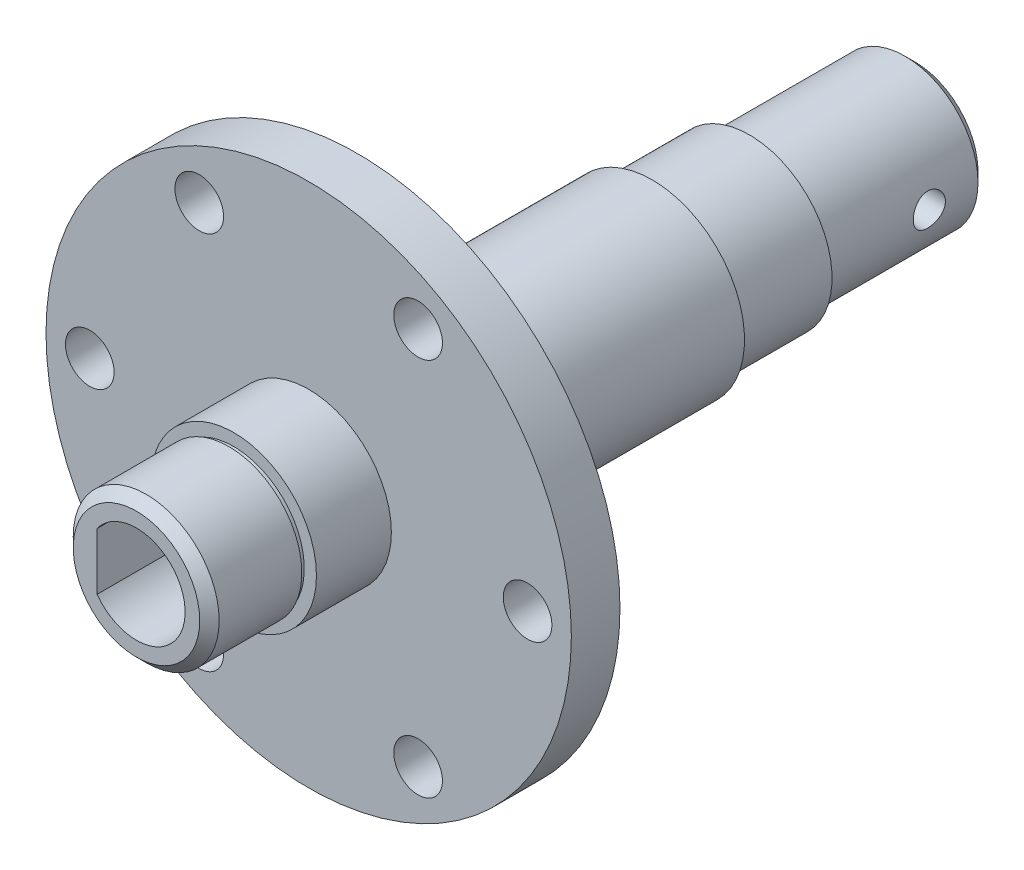
ISO-10303-21;
HEADER;
FILE_DESCRIPTION(('STEP AP214'),'2;1');
FILE_NAME('part.step','',(''),(''),'','','');
FILE_SCHEMA(('AUTOMOTIVE_DESIGN { 1 0 10303 214 1 1 1 1 }'));
ENDSEC;
DATA;
#1=APPLICATION_CONTEXT('core data for automotive mechanical design processes');
#2=APPLICATION_PROTOCOL_DEFINITION('international standard','automotive_design',2000,#1);
#3=PRODUCT_CONTEXT('',#1,'mechanical');
#4=PRODUCT('Part','Part','',(#3));
#5=PRODUCT_RELATED_PRODUCT_CATEGORY('part','',(#4));
#6=PRODUCT_DEFINITION_FORMATION('','',#4);
#7=PRODUCT_DEFINITION_CONTEXT('part definition',#1,'design');
#8=PRODUCT_DEFINITION('design','',#6,#7);
#9=PRODUCT_DEFINITION_SHAPE('','',#8);
#10=(LENGTH_UNIT() NAMED_UNIT(*) SI_UNIT(.MILLI.,.METRE.));
#11=(NAMED_UNIT(*) PLANE_ANGLE_UNIT() SI_UNIT($,.RADIAN.));
#12=(NAMED_UNIT(*) SI_UNIT($,.STERADIAN.) SOLID_ANGLE_UNIT());
#13=UNCERTAINTY_MEASURE_WITH_UNIT(LENGTH_MEASURE(1.E-05),#10,'distance_accuracy_value','');
#14=(GEOMETRIC_REPRESENTATION_CONTEXT(3) GLOBAL_UNCERTAINTY_ASSIGNED_CONTEXT((#13)) GLOBAL_UNIT_ASSIGNED_CONTEXT((#10,
#11,#12)) REPRESENTATION_CONTEXT('',''));
#15=CARTESIAN_POINT('',(0.,0.,0.));
#16=DIRECTION('',(0.,0.,1.));
#17=DIRECTION('',(1.,0.,0.));
#18=AXIS2_PLACEMENT_3D('',#15,#16,#17);
#19=CARTESIAN_POINT('',(0.,0.,64.));
#20=DIRECTION('',(0.,0.,-1.));
#21=DIRECTION('',(-1.,0.,0.));
#22=AXIS2_PLACEMENT_3D('',#19,#20,#21);
#23=CYLINDRICAL_SURFACE('',#22,7.5);
#24=CARTESIAN_POINT('',(0.,0.,63.));
#25=DIRECTION('',(0.,0.,1.));
#26=DIRECTION('',(1.,0.,0.));
#27=AXIS2_PLACEMENT_3D('',#24,#25,#26);
#28=CIRCLE('',#27,7.5);
#29=CARTESIAN_POINT('',(7.5,0.,63.));
#30=VERTEX_POINT('',#29);
#31=EDGE_CURVE('E227',#30,#30,#28,.F.);
#32=ORIENTED_EDGE('',*,*,#31,.T.);
#33=EDGE_LOOP('',(#32));
#34=FACE_BOUND('',#33,.T.);
#35=CARTESIAN_POINT('',(0.,0.,54.5));
#36=DIRECTION('',(0.,0.,-1.));
#37=DIRECTION('',(-1.,0.,0.));
#38=AXIS2_PLACEMENT_3D('',#35,#36,#37);
#39=CIRCLE('',#38,7.5);
#40=CARTESIAN_POINT('',(-7.5,0.,54.5));
#41=VERTEX_POINT('',#40);
#42=EDGE_CURVE('E327',#41,#41,#39,.T.);
#43=ORIENTED_EDGE('',*,*,#42,.F.);
#44=EDGE_LOOP('',(#43));
#45=FACE_BOUND('',#44,.T.);
#46=ADVANCED_FACE('F42',(#34,#45),#23,.T.);
#47=CARTESIAN_POINT('',(0.,0.,54.));
#48=DIRECTION('',(0.,0.,1.));
#49=DIRECTION('',(1.,0.,0.));
#50=AXIS2_PLACEMENT_3D('',#47,#48,#49);
#51=PLANE('',#50);
#52=CARTESIAN_POINT('',(0.,0.,54.));
#53=DIRECTION('',(0.,0.,1.));
#54=DIRECTION('',(1.,0.,0.));
#55=AXIS2_PLACEMENT_3D('',#52,#53,#54);
#56=CIRCLE('',#55,8.5);
#57=CARTESIAN_POINT('',(8.5,0.,54.));
#58=VERTEX_POINT('',#57);
#59=EDGE_CURVE('E313',#58,#58,#56,.T.);
#60=ORIENTED_EDGE('',*,*,#59,.T.);
#61=EDGE_LOOP('',(#60));
#62=FACE_BOUND('',#61,.T.);
#63=CARTESIAN_POINT('',(0.,0.,54.));
#64=DIRECTION('',(0.,0.,-1.));
#65=DIRECTION('',(-1.,0.,0.));
#66=AXIS2_PLACEMENT_3D('',#63,#64,#65);
#67=CIRCLE('',#66,7.25);
#68=CARTESIAN_POINT('',(-7.25,0.,54.));
#69=VERTEX_POINT('',#68);
#70=EDGE_CURVE('E298',#69,#69,#67,.T.);
#71=ORIENTED_EDGE('',*,*,#70,.T.);
#72=EDGE_LOOP('',(#71));
#73=FACE_BOUND('',#72,.T.);
#74=ADVANCED_FACE('F210',(#62,#73),#51,.T.);
#75=CARTESIAN_POINT('',(0.,0.,0.999999999999997));
#76=DIRECTION('',(0.,0.,-1.));
#77=DIRECTION('',(-1.,0.,0.));
#78=AXIS2_PLACEMENT_3D('',#75,#76,#77);
#79=PLANE('',#78);
#80=CARTESIAN_POINT('',(0.,0.,0.999999999999997));
#81=DIRECTION('',(0.,0.,-1.));
#82=DIRECTION('',(-1.,0.,0.));
#83=AXIS2_PLACEMENT_3D('',#80,#81,#82);
#84=CIRCLE('',#83,8.5);
#85=CARTESIAN_POINT('',(-8.5,0.,0.999999999999997));
#86=VERTEX_POINT('',#85);
#87=EDGE_CURVE('E292',#86,#86,#84,.T.);
#88=ORIENTED_EDGE('',*,*,#87,.T.);
#89=EDGE_LOOP('',(#88));
#90=FACE_BOUND('',#89,.T.);
#91=CARTESIAN_POINT('',(0.,0.,0.999999999999995));
#92=DIRECTION('',(0.,0.,1.));
#93=DIRECTION('',(1.,0.,0.));
#94=AXIS2_PLACEMENT_3D('',#91,#92,#93);
#95=CIRCLE('',#94,7.25);
#96=CARTESIAN_POINT('',(7.25,0.,0.999999999999995));
#97=VERTEX_POINT('',#96);
#98=EDGE_CURVE('E295',#97,#97,#95,.T.);
#99=ORIENTED_EDGE('',*,*,#98,.T.);
#100=EDGE_LOOP('',(#99));
#101=FACE_BOUND('',#100,.T.);
#102=ADVANCED_FACE('F213',(#90,#101),#79,.T.);
#103=CARTESIAN_POINT('',(0.,0.,11.3));
#104=DIRECTION('',(0.,0.,1.));
#105=DIRECTION('',(1.,0.,0.));
#106=AXIS2_PLACEMENT_3D('',#103,#104,#105);
#107=CYLINDRICAL_SURFACE('',#106,9.5);
#108=CARTESIAN_POINT('',(0.,0.,41.3));
#109=DIRECTION('',(0.,0.,-1.));
#110=DIRECTION('',(-1.,0.,0.));
#111=AXIS2_PLACEMENT_3D('',#108,#109,#110);
#112=CIRCLE('',#111,9.5);
#113=CARTESIAN_POINT('',(-9.5,0.,41.3));
#114=VERTEX_POINT('',#113);
#115=EDGE_CURVE('E149',#114,#114,#112,.T.);
#116=ORIENTED_EDGE('',*,*,#115,.T.);
#117=EDGE_LOOP('',(#116));
#118=FACE_BOUND('',#117,.T.);
#119=CARTESIAN_POINT('',(0.,0.,11.));
#120=DIRECTION('',(0.,0.,-1.));
#121=DIRECTION('',(-1.,0.,0.));
#122=AXIS2_PLACEMENT_3D('',#119,#120,#121);
#123=CIRCLE('',#122,9.5);
#124=CARTESIAN_POINT('',(-9.5,0.,11.));
#125=VERTEX_POINT('',#124);
#126=EDGE_CURVE('E172',#125,#125,#123,.T.);
#127=ORIENTED_EDGE('',*,*,#126,.F.);
#128=EDGE_LOOP('',(#127));
#129=FACE_BOUND('',#128,.T.);
#130=ADVANCED_FACE('F251',(#118,#129),#107,.T.);
#131=CARTESIAN_POINT('',(0.,0.,46.3));
#132=DIRECTION('',(0.,0.,1.));
#133=DIRECTION('',(1.,0.,0.));
#134=AXIS2_PLACEMENT_3D('',#131,#132,#133);
#135=PLANE('',#134);
#136=CARTESIAN_POINT('',(-11.2500000000001,-19.4855715851498,46.3));
#137=DIRECTION('',(0.,0.,1.));
#138=DIRECTION('',(1.,0.,0.));
#139=AXIS2_PLACEMENT_3D('',#136,#137,#138);
#140=CIRCLE('',#139,2.5);
#141=CARTESIAN_POINT('',(-8.75000000000009,-19.4855715851498,46.3));
#142=VERTEX_POINT('',#141);
#143=EDGE_CURVE('E125',#142,#142,#140,.T.);
#144=ORIENTED_EDGE('',*,*,#143,.F.);
#145=EDGE_LOOP('',(#144));
#146=FACE_BOUND('',#145,.T.);
#147=CARTESIAN_POINT('',(11.25,-19.4855715851499,46.3));
#148=DIRECTION('',(0.,0.,1.));
#149=DIRECTION('',(1.,0.,0.));
#150=AXIS2_PLACEMENT_3D('',#147,#148,#149);
#151=CIRCLE('',#150,2.5);
#152=CARTESIAN_POINT('',(13.75,-19.4855715851499,46.3));
#153=VERTEX_POINT('',#152);
#154=EDGE_CURVE('E133',#153,#153,#151,.T.);
#155=ORIENTED_EDGE('',*,*,#154,.F.);
#156=EDGE_LOOP('',(#155));
#157=FACE_BOUND('',#156,.T.);
#158=CARTESIAN_POINT('',(22.5,0.,46.3));
#159=DIRECTION('',(0.,0.,1.));
#160=DIRECTION('',(1.,0.,0.));
#161=AXIS2_PLACEMENT_3D('',#158,#159,#160);
#162=CIRCLE('',#161,2.5);
#163=CARTESIAN_POINT('',(25.,0.,46.3));
#164=VERTEX_POINT('',#163);
#165=EDGE_CURVE('E141',#164,#164,#162,.T.);
#166=ORIENTED_EDGE('',*,*,#165,.F.);
#167=EDGE_LOOP('',(#166));
#168=FACE_BOUND('',#167,.T.);
#169=CARTESIAN_POINT('',(-22.5,1.57116660247941E-13,46.3));
#170=DIRECTION('',(0.,0.,1.));
#171=DIRECTION('',(1.,0.,0.));
#172=AXIS2_PLACEMENT_3D('',#169,#170,#171);
#173=CIRCLE('',#172,2.5);
#174=CARTESIAN_POINT('',(-20.,1.57116660247941E-13,46.3));
#175=VERTEX_POINT('',#174);
#176=EDGE_CURVE('E117',#175,#175,#173,.T.);
#177=ORIENTED_EDGE('',*,*,#176,.F.);
#178=EDGE_LOOP('',(#177));
#179=FACE_BOUND('',#178,.T.);
#180=CARTESIAN_POINT('',(-11.2499999999998,19.48557158515,46.3));
#181=DIRECTION('',(0.,0.,1.));
#182=DIRECTION('',(1.,0.,0.));
#183=AXIS2_PLACEMENT_3D('',#180,#181,#182);
#184=CIRCLE('',#183,2.5);
#185=CARTESIAN_POINT('',(-8.74999999999982,19.48557158515,46.3));
#186=VERTEX_POINT('',#185);
#187=EDGE_CURVE('E109',#186,#186,#184,.T.);
#188=ORIENTED_EDGE('',*,*,#187,.F.);
#189=EDGE_LOOP('',(#188));
#190=FACE_BOUND('',#189,.T.);
#191=CARTESIAN_POINT('',(11.2500000000002,19.4855715851497,46.3));
#192=DIRECTION('',(0.,0.,1.));
#193=DIRECTION('',(1.,0.,0.));
#194=AXIS2_PLACEMENT_3D('',#191,#192,#193);
#195=CIRCLE('',#194,2.5);
#196=CARTESIAN_POINT('',(13.7500000000002,19.4855715851497,46.3));
#197=VERTEX_POINT('',#196);
#198=EDGE_CURVE('E78',#197,#197,#195,.T.);
#199=ORIENTED_EDGE('',*,*,#198,.F.);
#200=EDGE_LOOP('',(#199));
#201=FACE_BOUND('',#200,.T.);
#202=CARTESIAN_POINT('',(0.,0.,46.3));
#203=DIRECTION('',(0.,0.,1.));
#204=DIRECTION('',(1.,0.,0.));
#205=AXIS2_PLACEMENT_3D('',#202,#203,#204);
#206=CIRCLE('',#205,27.);
#207=CARTESIAN_POINT('',(27.,0.,46.3));
#208=VERTEX_POINT('',#207);
#209=EDGE_CURVE('E153',#208,#208,#206,.T.);
#210=ORIENTED_EDGE('',*,*,#209,.T.);
#211=EDGE_LOOP('',(#210));
#212=FACE_BOUND('',#211,.T.);
#213=CARTESIAN_POINT('',(0.,0.,46.3));
#214=DIRECTION('',(0.,0.,1.));
#215=DIRECTION('',(1.,0.,0.));
#216=AXIS2_PLACEMENT_3D('',#213,#214,#215);
#217=CIRCLE('',#216,8.5);
#218=CARTESIAN_POINT('',(8.5,0.,46.3));
#219=VERTEX_POINT('',#218);
#220=EDGE_CURVE('E314',#219,#219,#217,.T.);
#221=ORIENTED_EDGE('',*,*,#220,.F.);
#222=EDGE_LOOP('',(#221));
#223=FACE_BOUND('',#222,.T.);
#224=ADVANCED_FACE('F247',(#146,#157,#168,#179,#190,#201,#212,#223),#135,.T.);
#225=CARTESIAN_POINT('',(0.,0.,41.3));
#226=DIRECTION('',(0.,0.,-1.));
#227=DIRECTION('',(-1.,0.,0.));
#228=AXIS2_PLACEMENT_3D('',#225,#226,#227);
#229=PLANE('',#228);
#230=CARTESIAN_POINT('',(11.2500000000002,19.4855715851497,41.3));
#231=DIRECTION('',(0.,0.,-1.));
#232=DIRECTION('',(-1.,0.,0.));
#233=AXIS2_PLACEMENT_3D('',#230,#231,#232);
#234=CIRCLE('',#233,2.5);
#235=CARTESIAN_POINT('',(8.75000000000023,19.4855715851497,41.3));
#236=VERTEX_POINT('',#235);
#237=EDGE_CURVE('E105',#236,#236,#234,.T.);
#238=ORIENTED_EDGE('',*,*,#237,.F.);
#239=EDGE_LOOP('',(#238));
#240=FACE_BOUND('',#239,.T.);
#241=CARTESIAN_POINT('',(-11.2499999999998,19.48557158515,41.3));
#242=DIRECTION('',(0.,0.,-1.));
#243=DIRECTION('',(-1.,0.,0.));
#244=AXIS2_PLACEMENT_3D('',#241,#242,#243);
#245=CIRCLE('',#244,2.5);
#246=CARTESIAN_POINT('',(-13.7499999999998,19.48557158515,41.3));
#247=VERTEX_POINT('',#246);
#248=EDGE_CURVE('E113',#247,#247,#245,.T.);
#249=ORIENTED_EDGE('',*,*,#248,.F.);
#250=EDGE_LOOP('',(#249));
#251=FACE_BOUND('',#250,.T.);
#252=CARTESIAN_POINT('',(-22.5,1.57116660247941E-13,41.3));
#253=DIRECTION('',(0.,0.,-1.));
#254=DIRECTION('',(-1.,0.,0.));
#255=AXIS2_PLACEMENT_3D('',#252,#253,#254);
#256=CIRCLE('',#255,2.5);
#257=CARTESIAN_POINT('',(-25.,1.57116660247941E-13,41.3));
#258=VERTEX_POINT('',#257);
#259=EDGE_CURVE('E121',#258,#258,#256,.T.);
#260=ORIENTED_EDGE('',*,*,#259,.F.);
#261=EDGE_LOOP('',(#260));
#262=FACE_BOUND('',#261,.T.);
#263=CARTESIAN_POINT('',(-11.2500000000001,-19.4855715851498,41.3));
#264=DIRECTION('',(0.,0.,-1.));
#265=DIRECTION('',(-1.,0.,0.));
#266=AXIS2_PLACEMENT_3D('',#263,#264,#265);
#267=CIRCLE('',#266,2.5);
#268=CARTESIAN_POINT('',(-13.7500000000001,-19.4855715851498,41.3));
#269=VERTEX_POINT('',#268);
#270=EDGE_CURVE('E129',#269,#269,#267,.T.);
#271=ORIENTED_EDGE('',*,*,#270,.F.);
#272=EDGE_LOOP('',(#271));
#273=FACE_BOUND('',#272,.T.);
#274=CARTESIAN_POINT('',(11.25,-19.4855715851499,41.3));
#275=DIRECTION('',(0.,0.,-1.));
#276=DIRECTION('',(-1.,0.,0.));
#277=AXIS2_PLACEMENT_3D('',#274,#275,#276);
#278=CIRCLE('',#277,2.5);
#279=CARTESIAN_POINT('',(8.74999999999996,-19.4855715851499,41.3));
#280=VERTEX_POINT('',#279);
#281=EDGE_CURVE('E137',#280,#280,#278,.T.);
#282=ORIENTED_EDGE('',*,*,#281,.F.);
#283=EDGE_LOOP('',(#282));
#284=FACE_BOUND('',#283,.T.);
#285=CARTESIAN_POINT('',(22.5,0.,41.3));
#286=DIRECTION('',(0.,0.,-1.));
#287=DIRECTION('',(-1.,0.,0.));
#288=AXIS2_PLACEMENT_3D('',#285,#286,#287);
#289=CIRCLE('',#288,2.5);
#290=CARTESIAN_POINT('',(20.,0.,41.3));
#291=VERTEX_POINT('',#290);
#292=EDGE_CURVE('E145',#291,#291,#289,.T.);
#293=ORIENTED_EDGE('',*,*,#292,.F.);
#294=EDGE_LOOP('',(#293));
#295=FACE_BOUND('',#294,.T.);
#296=CARTESIAN_POINT('',(0.,0.,41.3));
#297=DIRECTION('',(0.,0.,1.));
#298=DIRECTION('',(1.,0.,0.));
#299=AXIS2_PLACEMENT_3D('',#296,#297,#298);
#300=CIRCLE('',#299,27.);
#301=CARTESIAN_POINT('',(27.,0.,41.3));
#302=VERTEX_POINT('',#301);
#303=EDGE_CURVE('E154',#302,#302,#300,.T.);
#304=ORIENTED_EDGE('',*,*,#303,.F.);
#305=EDGE_LOOP('',(#304));
#306=FACE_BOUND('',#305,.T.);
#307=ORIENTED_EDGE('',*,*,#115,.F.);
#308=EDGE_LOOP('',(#307));
#309=FACE_BOUND('',#308,.T.);
#310=ADVANCED_FACE('F250',(#240,#251,#262,#273,#284,#295,#306,#309),#229,.T.);
#311=CARTESIAN_POINT('',(0.,0.,41.3));
#312=DIRECTION('',(0.,0.,1.));
#313=DIRECTION('',(1.,0.,0.));
#314=AXIS2_PLACEMENT_3D('',#311,#312,#313);
#315=CYLINDRICAL_SURFACE('',#314,27.);
#316=ORIENTED_EDGE('',*,*,#303,.T.);
#317=EDGE_LOOP('',(#316));
#318=FACE_BOUND('',#317,.T.);
#319=ORIENTED_EDGE('',*,*,#209,.F.);
#320=EDGE_LOOP('',(#319));
#321=FACE_BOUND('',#320,.T.);
#322=ADVANCED_FACE('F255',(#318,#321),#315,.T.);
#323=CARTESIAN_POINT('',(22.5,0.,36.3));
#324=DIRECTION('',(0.,0.,1.));
#325=DIRECTION('',(1.,0.,0.));
#326=AXIS2_PLACEMENT_3D('',#323,#324,#325);
#327=CYLINDRICAL_SURFACE('',#326,2.5);
#328=ORIENTED_EDGE('',*,*,#292,.T.);
#329=EDGE_LOOP('',(#328));
#330=FACE_BOUND('',#329,.T.);
#331=ORIENTED_EDGE('',*,*,#165,.T.);
#332=EDGE_LOOP('',(#331));
#333=FACE_BOUND('',#332,.T.);
#334=ADVANCED_FACE('F259',(#330,#333),#327,.F.);
#335=CARTESIAN_POINT('',(11.25,-19.4855715851499,36.3));
#336=DIRECTION('',(0.,0.,1.));
#337=DIRECTION('',(1.,0.,0.));
#338=AXIS2_PLACEMENT_3D('',#335,#336,#337);
#339=CYLINDRICAL_SURFACE('',#338,2.5);
#340=ORIENTED_EDGE('',*,*,#281,.T.);
#341=EDGE_LOOP('',(#340));
#342=FACE_BOUND('',#341,.T.);
#343=ORIENTED_EDGE('',*,*,#154,.T.);
#344=EDGE_LOOP('',(#343));
#345=FACE_BOUND('',#344,.T.);
#346=ADVANCED_FACE('F266',(#342,#345),#339,.F.);
#347=CARTESIAN_POINT('',(-11.2500000000001,-19.4855715851498,36.3));
#348=DIRECTION('',(0.,0.,1.));
#349=DIRECTION('',(1.,0.,0.));
#350=AXIS2_PLACEMENT_3D('',#347,#348,#349);
#351=CYLINDRICAL_SURFACE('',#350,2.5);
#352=ORIENTED_EDGE('',*,*,#270,.T.);
#353=EDGE_LOOP('',(#352));
#354=FACE_BOUND('',#353,.T.);
#355=ORIENTED_EDGE('',*,*,#143,.T.);
#356=EDGE_LOOP('',(#355));
#357=FACE_BOUND('',#356,.T.);
#358=ADVANCED_FACE('F270',(#354,#357),#351,.F.);
#359=CARTESIAN_POINT('',(-22.5,1.57116660247941E-13,36.3));
#360=DIRECTION('',(0.,0.,1.));
#361=DIRECTION('',(1.,0.,0.));
#362=AXIS2_PLACEMENT_3D('',#359,#360,#361);
#363=CYLINDRICAL_SURFACE('',#362,2.5);
#364=ORIENTED_EDGE('',*,*,#259,.T.);
#365=EDGE_LOOP('',(#364));
#366=FACE_BOUND('',#365,.T.);
#367=ORIENTED_EDGE('',*,*,#176,.T.);
#368=EDGE_LOOP('',(#367));
#369=FACE_BOUND('',#368,.T.);
#370=ADVANCED_FACE('F274',(#366,#369),#363,.F.);
#371=CARTESIAN_POINT('',(-11.2499999999998,19.48557158515,36.3));
#372=DIRECTION('',(0.,0.,1.));
#373=DIRECTION('',(1.,0.,0.));
#374=AXIS2_PLACEMENT_3D('',#371,#372,#373);
#375=CYLINDRICAL_SURFACE('',#374,2.5);
#376=ORIENTED_EDGE('',*,*,#248,.T.);
#377=EDGE_LOOP('',(#376));
#378=FACE_BOUND('',#377,.T.);
#379=ORIENTED_EDGE('',*,*,#187,.T.);
#380=EDGE_LOOP('',(#379));
#381=FACE_BOUND('',#380,.T.);
#382=ADVANCED_FACE('F278',(#378,#381),#375,.F.);
#383=CARTESIAN_POINT('',(11.2500000000002,19.4855715851497,36.3));
#384=DIRECTION('',(0.,0.,1.));
#385=DIRECTION('',(1.,0.,0.));
#386=AXIS2_PLACEMENT_3D('',#383,#384,#385);
#387=CYLINDRICAL_SURFACE('',#386,2.5);
#388=ORIENTED_EDGE('',*,*,#237,.T.);
#389=EDGE_LOOP('',(#388));
#390=FACE_BOUND('',#389,.T.);
#391=ORIENTED_EDGE('',*,*,#198,.T.);
#392=EDGE_LOOP('',(#391));
#393=FACE_BOUND('',#392,.T.);
#394=ADVANCED_FACE('F220',(#390,#393),#387,.F.);
#395=CARTESIAN_POINT('',(0.,0.,-16.));
#396=DIRECTION('',(0.,0.,1.));
#397=DIRECTION('',(1.,0.,0.));
#398=AXIS2_PLACEMENT_3D('',#395,#396,#397);
#399=CYLINDRICAL_SURFACE('',#398,7.5);
#400=CARTESIAN_POINT('',(0.,0.,0.499999999999997));
#401=DIRECTION('',(0.,0.,1.));
#402=DIRECTION('',(1.,0.,0.));
#403=AXIS2_PLACEMENT_3D('',#400,#401,#402);
#404=CIRCLE('',#403,7.5);
#405=CARTESIAN_POINT('',(7.5,0.,0.499999999999997));
#406=VERTEX_POINT('',#405);
#407=EDGE_CURVE('E302',#406,#406,#404,.T.);
#408=ORIENTED_EDGE('',*,*,#407,.F.);
#409=EDGE_LOOP('',(#408));
#410=FACE_BOUND('',#409,.T.);
#411=CARTESIAN_POINT('',(0.,0.,-15.));
#412=DIRECTION('',(0.,0.,-1.));
#413=DIRECTION('',(-1.,0.,0.));
#414=AXIS2_PLACEMENT_3D('',#411,#412,#413);
#415=CIRCLE('',#414,7.5);
#416=CARTESIAN_POINT('',(-7.5,0.,-15.));
#417=VERTEX_POINT('',#416);
#418=EDGE_CURVE('E11',#417,#417,#415,.F.);
#419=ORIENTED_EDGE('',*,*,#418,.T.);
#420=EDGE_LOOP('',(#419));
#421=FACE_BOUND('',#420,.T.);
#422=CARTESIAN_POINT('',(7.5,0.,-11.65));
#423=CARTESIAN_POINT('',(7.49999831424106,-0.0914999393408011,-11.6499968938833));
#424=CARTESIAN_POINT('',(7.49830854961464,-0.183037296855732,-11.6423631810687));
#425=CARTESIAN_POINT('',(7.49173097533343,-0.363511023320149,-11.6120622594087));
#426=CARTESIAN_POINT('',(7.48684089859969,-0.452445501715037,-11.5893843932336));
#427=CARTESIAN_POINT('',(7.47440705823353,-0.625079242768202,-11.5297405539692));
#428=CARTESIAN_POINT('',(7.46686608345357,-0.708783898837724,-11.4927895927343));
#429=CARTESIAN_POINT('',(7.4499439147352,-0.868802700314479,-11.4056963089162));
#430=CARTESIAN_POINT('',(7.44056276410836,-0.945117019602317,-11.3555542967966));
#431=CARTESIAN_POINT('',(7.42081741826453,-1.08942970934261,-11.2426414891892));
#432=CARTESIAN_POINT('',(7.41044091267737,-1.15729102940931,-11.1796976688705));
#433=CARTESIAN_POINT('',(7.38996090019822,-1.28158292851941,-11.0433394017875));
#434=CARTESIAN_POINT('',(7.3798574179456,-1.33801247885254,-10.9699240137307));
#435=CARTESIAN_POINT('',(7.36094592663126,-1.43844520787671,-10.8136913429298));
#436=CARTESIAN_POINT('',(7.35215368644803,-1.48230220287272,-10.7307780079661));
#437=CARTESIAN_POINT('',(7.33703697303094,-1.55540709540188,-10.5585327458251));
#438=CARTESIAN_POINT('',(7.33071220104563,-1.58465676165372,-10.4692015972436));
#439=CARTESIAN_POINT('',(7.3213719537811,-1.62726320761459,-10.2881439593966));
#440=CARTESIAN_POINT('',(7.31830597985859,-1.64086278535652,-10.1964772663027));
#441=CARTESIAN_POINT('',(7.31567882302511,-1.65253801366901,-10.0121160641517));
#442=CARTESIAN_POINT('',(7.31611720410754,-1.6506155954628,-9.91942168439078));
#443=CARTESIAN_POINT('',(7.32040352024315,-1.6314967280213,-9.73744348167057));
#444=CARTESIAN_POINT('',(7.32418842940723,-1.61458260643201,-9.64812828725854));
#445=CARTESIAN_POINT('',(7.33464165989446,-1.5664078726783,-9.47363508632754));
#446=CARTESIAN_POINT('',(7.34131014468067,-1.53514644719315,-9.38845731465378));
#447=CARTESIAN_POINT('',(7.35684109933612,-1.45890598688934,-9.22386456484735));
#448=CARTESIAN_POINT('',(7.36572078647476,-1.41381862824297,-9.14450145530904));
#449=CARTESIAN_POINT('',(7.3846631014116,-1.3112823169619,-8.99436318177397));
#450=CARTESIAN_POINT('',(7.39472589215443,-1.25383166066753,-8.92358920346178));
#451=CARTESIAN_POINT('',(7.41517081765931,-1.12670629880249,-8.79101303710661));
#452=CARTESIAN_POINT('',(7.42555512168707,-1.05679158832993,-8.72944109133507));
#453=CARTESIAN_POINT('',(7.44527255252899,-0.907510905058956,-8.61885837608795));
#454=CARTESIAN_POINT('',(7.45460565986633,-0.828144757198041,-8.56984783933175));
#455=CARTESIAN_POINT('',(7.4711999610659,-0.661931267895291,-8.48572123553566));
#456=CARTESIAN_POINT('',(7.47845660535503,-0.575068033653586,-8.45063561420552));
#457=CARTESIAN_POINT('',(7.49004657125319,-0.396483640858849,-8.39562258522819));
#458=CARTESIAN_POINT('',(7.49438032302729,-0.304763199289835,-8.37569294700434));
#459=CARTESIAN_POINT('',(7.49957488574714,-0.121042700683247,-8.35189313774669));
#460=CARTESIAN_POINT('',(7.50050369388944,-0.0290852501339719,-8.34770849163739));
#461=CARTESIAN_POINT('',(7.49897438369855,0.154214783533879,-8.35466469502872));
#462=CARTESIAN_POINT('',(7.49651649791089,0.245557408436373,-8.3658044922846));
#463=CARTESIAN_POINT('',(7.48853291011624,0.423991007748931,-8.40283265132216));
#464=CARTESIAN_POINT('',(7.48304158779087,0.511117938303424,-8.42855581582791));
#465=CARTESIAN_POINT('',(7.46960587824172,0.679820246095632,-8.49383695756339));
#466=CARTESIAN_POINT('',(7.46166128036508,0.761395145868541,-8.5333961228733));
#467=CARTESIAN_POINT('',(7.44403270371493,0.917976261781451,-8.62587978321852));
#468=CARTESIAN_POINT('',(7.43432530594193,0.992870859505148,-8.6789886922759));
#469=CARTESIAN_POINT('',(7.41429527403409,1.13279771208182,-8.79682171018652));
#470=CARTESIAN_POINT('',(7.40397255911623,1.19782866797858,-8.86154734641593));
#471=CARTESIAN_POINT('',(7.38364007713336,1.3174275998863,-9.00222027859978));
#472=CARTESIAN_POINT('',(7.373639743821,1.37177769648958,-9.0783544312955));
#473=CARTESIAN_POINT('',(7.35530407569124,1.46692164784539,-9.23885442521818));
#474=CARTESIAN_POINT('',(7.34696866856884,1.50771609134851,-9.32321990873516));
#475=CARTESIAN_POINT('',(7.33298679212086,1.57431369753846,-9.4973341693029));
#476=CARTESIAN_POINT('',(7.32732517503717,1.60020149826091,-9.58704929627586));
#477=CARTESIAN_POINT('',(7.31930499643681,1.63649815552641,-9.76969698070692));
#478=CARTESIAN_POINT('',(7.3169458996267,1.64690952060538,-9.86262901424551));
#479=CARTESIAN_POINT('',(7.31583187657225,1.65185003885159,-10.0468749692852));
#480=CARTESIAN_POINT('',(7.3169985317166,1.64672474541726,-10.1381793199423));
#481=CARTESIAN_POINT('',(7.32262705863688,1.62151064971411,-10.3185891137549));
#482=CARTESIAN_POINT('',(7.32708889063959,1.60142202805462,-10.4076945834377));
#483=CARTESIAN_POINT('',(7.33876659051329,1.54701934318005,-10.5808988736445));
#484=CARTESIAN_POINT('',(7.34597260690617,1.51275612845809,-10.6650143737403));
#485=CARTESIAN_POINT('',(7.36233049430586,1.43102033898959,-10.8263541622608));
#486=CARTESIAN_POINT('',(7.37148257073497,1.38354636957811,-10.903577721963));
#487=CARTESIAN_POINT('',(7.3909352154142,1.27559296460682,-11.0506437088594));
#488=CARTESIAN_POINT('',(7.40125543681466,1.21486750796967,-11.1203029796525));
#489=CARTESIAN_POINT('',(7.42175007997792,1.08263275210778,-11.2485559345428));
#490=CARTESIAN_POINT('',(7.43192446746263,1.01112096165039,-11.3071470552587));
#491=CARTESIAN_POINT('',(7.45113988726204,0.858209468643987,-11.4123391516625));
#492=CARTESIAN_POINT('',(7.46016424553825,0.776692042971305,-11.4587722186165));
#493=CARTESIAN_POINT('',(7.47589523887679,0.606827789468279,-11.5372038983213));
#494=CARTESIAN_POINT('',(7.48260380597825,0.51848673019753,-11.5692145503732));
#495=CARTESIAN_POINT('',(7.49175811514749,0.358388456603653,-11.6122237689109));
#496=CARTESIAN_POINT('',(7.4948296001288,0.287493809384326,-11.6263626938008));
#497=CARTESIAN_POINT('',(7.49895116200565,0.144407171386656,-11.645251822437));
#498=CARTESIAN_POINT('',(7.5000013304652,0.0722152395237922,-11.6500024514657));
#499=CARTESIAN_POINT('',(7.5,0.,-11.65));
#500=B_SPLINE_CURVE_WITH_KNOTS('',3,(#422,#423,#424,#425,#426,#427,#428,#429,#430,#431,#432,
#433,#434,#435,#436,#437,#438,#439,#440,#441,#442,#443,#444,#445,#446,#447,#448,#449,#450,#451,
#452,#453,#454,#455,#456,#457,#458,#459,#460,#461,#462,#463,#464,#465,#466,#467,#468,#469,#470,
#471,#472,#473,#474,#475,#476,#477,#478,#479,#480,#481,#482,#483,#484,#485,#486,#487,#488,#489,
#490,#491,#492,#493,#494,#495,#496,#497,#498,#499),.UNSPECIFIED.,.T.,.F.,(4,2,2,2,2,2,2,2,2,2,2,
2,2,2,2,2,2,2,2,2,2,2,2,2,2,2,2,2,2,2,2,2,2,2,2,2,2,2,4),(0.,0.274235469748509,
0.548665416592522,0.822807511778602,1.09694315535338,1.37506480293447,1.65321146673233,
1.93447194708655,2.21569836294015,2.49250033112996,2.76926786056845,3.04093142111883,
3.31261038365022,3.58647477653389,3.86037693206285,4.14027337309168,4.42017499925701,
4.70068528026744,4.98115426927861,5.25599076583745,5.53080839183635,5.80257342230781,
6.07436179463611,6.35006739343502,6.62580926880842,6.90669641720308,7.1875713644818,
7.46683540152297,7.74605416843228,8.01910869065847,8.29215991713438,8.56424000622431,
8.83634882982829,9.11402013989234,9.39175567994315,9.67314563039328,9.95430024968245,
10.1707471396203,10.3871842244587),.UNSPECIFIED.);
#501=CARTESIAN_POINT('',(7.5,0.,-11.65));
#502=VERTEX_POINT('',#501);
#503=EDGE_CURVE('E171',#502,#502,#500,.T.);
#504=ORIENTED_EDGE('',*,*,#503,.T.);
#505=EDGE_LOOP('',(#504));
#506=FACE_BOUND('',#505,.T.);
#507=CARTESIAN_POINT('',(-7.5,0.,-8.35000000000001));
#508=CARTESIAN_POINT('',(-7.49999831424106,-0.0914999393408011,-8.35000310611671));
#509=CARTESIAN_POINT('',(-7.49830854961464,-0.183037296855732,-8.35763681893135));
#510=CARTESIAN_POINT('',(-7.49173097533343,-0.363511023320149,-8.38793774059133));
#511=CARTESIAN_POINT('',(-7.48684089859969,-0.452445501715037,-8.41061560676644));
#512=CARTESIAN_POINT('',(-7.47440705823353,-0.625079242768202,-8.4702594460308));
#513=CARTESIAN_POINT('',(-7.46686608345357,-0.708783898837724,-8.50721040726571));
#514=CARTESIAN_POINT('',(-7.4499439147352,-0.868802700314479,-8.59430369108382));
#515=CARTESIAN_POINT('',(-7.44056276410836,-0.945117019602317,-8.64444570320342));
#516=CARTESIAN_POINT('',(-7.42081741826453,-1.08942970934261,-8.75735851081085));
#517=CARTESIAN_POINT('',(-7.41044091267737,-1.15729102940931,-8.82030233112952));
#518=CARTESIAN_POINT('',(-7.38996090019822,-1.28158292851941,-8.95666059821246));
#519=CARTESIAN_POINT('',(-7.3798574179456,-1.33801247885254,-9.03007598626926));
#520=CARTESIAN_POINT('',(-7.36094592663126,-1.43844520787671,-9.18630865707019));
#521=CARTESIAN_POINT('',(-7.35215368644803,-1.48230220287272,-9.2692219920339));
#522=CARTESIAN_POINT('',(-7.33703697303094,-1.55540709540188,-9.4414672541749));
#523=CARTESIAN_POINT('',(-7.33071220104563,-1.58465676165372,-9.53079840275644));
#524=CARTESIAN_POINT('',(-7.3213719537811,-1.62726320761459,-9.71185604060337));
#525=CARTESIAN_POINT('',(-7.31830597985859,-1.64086278535652,-9.80352273369726));
#526=CARTESIAN_POINT('',(-7.31567882302511,-1.65253801366901,-9.98788393584834));
#527=CARTESIAN_POINT('',(-7.31611720410754,-1.6506155954628,-10.0805783156092));
#528=CARTESIAN_POINT('',(-7.32040352024315,-1.6314967280213,-10.2625565183294));
#529=CARTESIAN_POINT('',(-7.32418842940723,-1.61458260643201,-10.3518717127415));
#530=CARTESIAN_POINT('',(-7.33464165989446,-1.5664078726783,-10.5263649136725));
#531=CARTESIAN_POINT('',(-7.34131014468067,-1.53514644719315,-10.6115426853462));
#532=CARTESIAN_POINT('',(-7.35684109933612,-1.45890598688934,-10.7761354351527));
#533=CARTESIAN_POINT('',(-7.36572078647476,-1.41381862824297,-10.855498544691));
#534=CARTESIAN_POINT('',(-7.3846631014116,-1.3112823169619,-11.005636818226));
#535=CARTESIAN_POINT('',(-7.39472589215443,-1.25383166066753,-11.0764107965382));
#536=CARTESIAN_POINT('',(-7.41517081765931,-1.12670629880249,-11.2089869628934));
#537=CARTESIAN_POINT('',(-7.42555512168707,-1.05679158832993,-11.2705589086649));
#538=CARTESIAN_POINT('',(-7.44527255252899,-0.907510905058956,-11.3811416239121));
#539=CARTESIAN_POINT('',(-7.45460565986633,-0.828144757198041,-11.4301521606682));
#540=CARTESIAN_POINT('',(-7.4711999610659,-0.661931267895291,-11.5142787644643));
#541=CARTESIAN_POINT('',(-7.47845660535503,-0.575068033653586,-11.5493643857945));
#542=CARTESIAN_POINT('',(-7.49004657125319,-0.396483640858849,-11.6043774147718));
#543=CARTESIAN_POINT('',(-7.49438032302729,-0.304763199289835,-11.6243070529957));
#544=CARTESIAN_POINT('',(-7.49957488574714,-0.121042700683247,-11.6481068622533));
#545=CARTESIAN_POINT('',(-7.50050369388944,-0.0290852501339719,-11.6522915083626));
#546=CARTESIAN_POINT('',(-7.49897438369855,0.154214783533879,-11.6453353049713));
#547=CARTESIAN_POINT('',(-7.49651649791089,0.245557408436373,-11.6341955077154));
#548=CARTESIAN_POINT('',(-7.48853291011624,0.423991007748931,-11.5971673486778));
#549=CARTESIAN_POINT('',(-7.48304158779087,0.511117938303424,-11.5714441841721));
#550=CARTESIAN_POINT('',(-7.46960587824172,0.679820246095632,-11.5061630424366));
#551=CARTESIAN_POINT('',(-7.46166128036508,0.761395145868541,-11.4666038771267));
#552=CARTESIAN_POINT('',(-7.44403270371493,0.917976261781451,-11.3741202167815));
#553=CARTESIAN_POINT('',(-7.43432530594193,0.992870859505148,-11.3210113077241));
#554=CARTESIAN_POINT('',(-7.41429527403409,1.13279771208182,-11.2031782898135));
#555=CARTESIAN_POINT('',(-7.40397255911623,1.19782866797858,-11.1384526535841));
#556=CARTESIAN_POINT('',(-7.38364007713336,1.3174275998863,-10.9977797214002));
#557=CARTESIAN_POINT('',(-7.373639743821,1.37177769648958,-10.9216455687045));
#558=CARTESIAN_POINT('',(-7.35530407569124,1.46692164784539,-10.7611455747818));
#559=CARTESIAN_POINT('',(-7.34696866856884,1.50771609134851,-10.6767800912648));
#560=CARTESIAN_POINT('',(-7.33298679212086,1.57431369753846,-10.5026658306971));
#561=CARTESIAN_POINT('',(-7.32732517503717,1.60020149826091,-10.4129507037241));
#562=CARTESIAN_POINT('',(-7.31930499643681,1.63649815552641,-10.2303030192931));
#563=CARTESIAN_POINT('',(-7.3169458996267,1.64690952060538,-10.1373709857545));
#564=CARTESIAN_POINT('',(-7.31583187657225,1.65185003885159,-9.9531250307148));
#565=CARTESIAN_POINT('',(-7.3169985317166,1.64672474541726,-9.86182068005766));
#566=CARTESIAN_POINT('',(-7.32262705863688,1.62151064971411,-9.68141088624511));
#567=CARTESIAN_POINT('',(-7.32708889063959,1.60142202805462,-9.59230541656233));
#568=CARTESIAN_POINT('',(-7.33876659051329,1.54701934318005,-9.41910112635546));
#569=CARTESIAN_POINT('',(-7.34597260690617,1.51275612845809,-9.33498562625966));
#570=CARTESIAN_POINT('',(-7.36233049430586,1.43102033898959,-9.17364583773919));
#571=CARTESIAN_POINT('',(-7.37148257073497,1.38354636957811,-9.09642227803702));
#572=CARTESIAN_POINT('',(-7.3909352154142,1.27559296460682,-8.94935629114057));
#573=CARTESIAN_POINT('',(-7.40125543681466,1.21486750796967,-8.87969702034748));
#574=CARTESIAN_POINT('',(-7.42175007997792,1.08263275210778,-8.7514440654572));
#575=CARTESIAN_POINT('',(-7.43192446746263,1.01112096165039,-8.69285294474133));
#576=CARTESIAN_POINT('',(-7.45113988726204,0.858209468643987,-8.58766084833746));
#577=CARTESIAN_POINT('',(-7.46016424553825,0.776692042971305,-8.54122778138352));
#578=CARTESIAN_POINT('',(-7.47589523887679,0.606827789468279,-8.46279610167867));
#579=CARTESIAN_POINT('',(-7.48260380597825,0.51848673019753,-8.43078544962678));
#580=CARTESIAN_POINT('',(-7.49175811514749,0.358388456603653,-8.38777623108907));
#581=CARTESIAN_POINT('',(-7.4948296001288,0.287493809384326,-8.37363730619918));
#582=CARTESIAN_POINT('',(-7.49895116200565,0.144407171386656,-8.35474817756303));
#583=CARTESIAN_POINT('',(-7.5000013304652,0.0722152395237922,-8.34999754853432));
#584=CARTESIAN_POINT('',(-7.5,0.,-8.35000000000001));
#585=B_SPLINE_CURVE_WITH_KNOTS('',3,(#507,#508,#509,#510,#511,#512,#513,#514,#515,#516,#517,
#518,#519,#520,#521,#522,#523,#524,#525,#526,#527,#528,#529,#530,#531,#532,#533,#534,#535,#536,
#537,#538,#539,#540,#541,#542,#543,#544,#545,#546,#547,#548,#549,#550,#551,#552,#553,#554,#555,
#556,#557,#558,#559,#560,#561,#562,#563,#564,#565,#566,#567,#568,#569,#570,#571,#572,#573,#574,
#575,#576,#577,#578,#579,#580,#581,#582,#583,#584),.UNSPECIFIED.,.T.,.F.,(4,2,2,2,2,2,2,2,2,2,2,
2,2,2,2,2,2,2,2,2,2,2,2,2,2,2,2,2,2,2,2,2,2,2,2,2,2,2,4),(0.,0.274235469748509,
0.548665416592522,0.822807511778602,1.09694315535338,1.37506480293447,1.65321146673233,
1.93447194708655,2.21569836294015,2.49250033112996,2.76926786056845,3.04093142111883,
3.31261038365022,3.58647477653389,3.86037693206285,4.14027337309168,4.42017499925701,
4.70068528026744,4.98115426927861,5.25599076583745,5.53080839183635,5.80257342230781,
6.07436179463611,6.35006739343502,6.62580926880842,6.90669641720308,7.1875713644818,
7.46683540152297,7.74605416843228,8.01910869065847,8.29215991713438,8.56424000622431,
8.83634882982829,9.11402013989234,9.39175567994315,9.67314563039328,9.95430024968245,
10.1707471396203,10.3871842244587),.UNSPECIFIED.);
#586=CARTESIAN_POINT('',(-7.5,0.,-8.35000000000001));
#587=VERTEX_POINT('',#586);
#588=EDGE_CURVE('E162',#587,#587,#585,.T.);
#589=ORIENTED_EDGE('',*,*,#588,.T.);
#590=EDGE_LOOP('',(#589));
#591=FACE_BOUND('',#590,.T.);
#592=ADVANCED_FACE('F177',(#410,#421,#506,#591),#399,.T.);
#593=CARTESIAN_POINT('',(0.,0.,-16.));
#594=DIRECTION('',(0.,0.,-1.));
#595=DIRECTION('',(-1.,0.,0.));
#596=AXIS2_PLACEMENT_3D('',#593,#594,#595);
#597=PLANE('',#596);
#598=CARTESIAN_POINT('',(0.,0.,-16.));
#599=DIRECTION('',(0.,0.,-1.));
#600=DIRECTION('',(-1.,0.,0.));
#601=AXIS2_PLACEMENT_3D('',#598,#599,#600);
#602=CIRCLE('',#601,6.50000000000001);
#603=CARTESIAN_POINT('',(-6.50000000000001,0.,-16.));
#604=VERTEX_POINT('',#603);
#605=EDGE_CURVE('E51',#604,#604,#602,.T.);
#606=ORIENTED_EDGE('',*,*,#605,.T.);
#607=EDGE_LOOP('',(#606));
#608=FACE_BOUND('',#607,.T.);
#609=CARTESIAN_POINT('',(0.,0.,-16.));
#610=DIRECTION('',(0.,0.,-1.));
#611=DIRECTION('',(-1.,0.,0.));
#612=AXIS2_PLACEMENT_3D('',#609,#610,#611);
#613=CIRCLE('',#612,5.);
#614=CARTESIAN_POINT('',(-4.05,2.93214938227915,-16.));
#615=VERTEX_POINT('',#614);
#616=CARTESIAN_POINT('',(-4.05,-2.93214938227915,-16.));
#617=VERTEX_POINT('',#616);
#618=EDGE_CURVE('E58',#615,#617,#613,.T.);
#619=ORIENTED_EDGE('',*,*,#618,.F.);
#620=DIRECTION('',(0.,1.,0.));
#621=VECTOR('',#620,1.);
#622=CARTESIAN_POINT('',(-4.05,2.93214938227915,-16.));
#623=LINE('',#622,#621);
#624=EDGE_CURVE('E83',#617,#615,#623,.T.);
#625=ORIENTED_EDGE('',*,*,#624,.F.);
#626=EDGE_LOOP('',(#619,#625));
#627=FACE_BOUND('',#626,.T.);
#628=ADVANCED_FACE('F206',(#608,#627),#597,.T.);
#629=CARTESIAN_POINT('',(0.,0.,64.));
#630=DIRECTION('',(0.,0.,1.));
#631=DIRECTION('',(1.,0.,0.));
#632=AXIS2_PLACEMENT_3D('',#629,#630,#631);
#633=PLANE('',#632);
#634=CARTESIAN_POINT('',(0.,0.,64.));
#635=DIRECTION('',(0.,0.,1.));
#636=DIRECTION('',(1.,0.,0.));
#637=AXIS2_PLACEMENT_3D('',#634,#635,#636);
#638=CIRCLE('',#637,6.50000000000001);
#639=CARTESIAN_POINT('',(6.50000000000001,0.,64.));
#640=VERTEX_POINT('',#639);
#641=EDGE_CURVE('E158',#640,#640,#638,.T.);
#642=ORIENTED_EDGE('',*,*,#641,.T.);
#643=EDGE_LOOP('',(#642));
#644=FACE_BOUND('',#643,.T.);
#645=CARTESIAN_POINT('',(0.,0.,64.));
#646=DIRECTION('',(0.,0.,1.));
#647=DIRECTION('',(1.,0.,0.));
#648=AXIS2_PLACEMENT_3D('',#645,#646,#647);
#649=CIRCLE('',#648,5.);
#650=CARTESIAN_POINT('',(-4.05,2.93214938227915,64.));
#651=VERTEX_POINT('',#650);
#652=CARTESIAN_POINT('',(-4.05,-2.93214938227915,64.));
#653=VERTEX_POINT('',#652);
#654=EDGE_CURVE('E81',#651,#653,#649,.F.);
#655=ORIENTED_EDGE('',*,*,#654,.T.);
#656=DIRECTION('',(0.,1.,0.));
#657=VECTOR('',#656,1.);
#658=CARTESIAN_POINT('',(-4.05,2.93214938227915,64.));
#659=LINE('',#658,#657);
#660=EDGE_CURVE('E71',#653,#651,#659,.T.);
#661=ORIENTED_EDGE('',*,*,#660,.T.);
#662=EDGE_LOOP('',(#655,#661));
#663=FACE_BOUND('',#662,.T.);
#664=ADVANCED_FACE('F85',(#644,#663),#633,.T.);
#665=CARTESIAN_POINT('',(0.,0.,64.001));
#666=DIRECTION('',(0.,0.,-1.));
#667=DIRECTION('',(-1.,0.,0.));
#668=AXIS2_PLACEMENT_3D('',#665,#666,#667);
#669=CYLINDRICAL_SURFACE('',#668,5.);
#670=CARTESIAN_POINT('',(5.,0.,-8.35000000000001));
#671=CARTESIAN_POINT('',(5.00000012564882,-0.0900803323989866,-8.34999975748561));
#672=CARTESIAN_POINT('',(4.99754312617873,-0.180159574077353,-8.35740083748496));
#673=CARTESIAN_POINT('',(4.98798348171152,-0.357667875169256,-8.38672114952764));
#674=CARTESIAN_POINT('',(4.98088026257134,-0.445096605656319,-8.40864217583529));
#675=CARTESIAN_POINT('',(4.962800681432,-0.614719075952392,-8.46617131238829));
#676=CARTESIAN_POINT('',(4.95183071876683,-0.696921201899964,-8.50175681701404));
#677=CARTESIAN_POINT('',(4.92713947248839,-0.854190645874481,-8.58550357269186));
#678=CARTESIAN_POINT('',(4.91341766335966,-0.929256597076051,-8.63366722630343));
#679=CARTESIAN_POINT('',(4.88414667976015,-1.07267700256013,-8.74292482307141));
#680=CARTESIAN_POINT('',(4.86855436886587,-1.140755021368,-8.80437001827416));
#681=CARTESIAN_POINT('',(4.83753907804007,-1.26585047260416,-8.93769951391984));
#682=CARTESIAN_POINT('',(4.8221161350793,-1.32286553369749,-9.00958604669272));
#683=CARTESIAN_POINT('',(4.79271313173333,-1.42578155512387,-9.16423061237946));
#684=CARTESIAN_POINT('',(4.77878574898835,-1.47132547146369,-9.24723723758517));
#685=CARTESIAN_POINT('',(4.75460549483772,-1.5476895000705,-9.42026563083408));
#686=CARTESIAN_POINT('',(4.74435152777497,-1.57851400356115,-9.51028529735234));
#687=CARTESIAN_POINT('',(4.72913282635101,-1.62353134991423,-9.69164482908127));
#688=CARTESIAN_POINT('',(4.72400412235767,-1.63824134173319,-9.78284216332565));
#689=CARTESIAN_POINT('',(4.7191313464795,-1.65222861163855,-9.96654361269401));
#690=CARTESIAN_POINT('',(4.71938564975367,-1.65151054662634,-10.0590473250677));
#691=CARTESIAN_POINT('',(4.72510629107568,-1.63506410098719,-10.2383472023923));
#692=CARTESIAN_POINT('',(4.73033928879681,-1.62000769651632,-10.3252137352388));
#693=CARTESIAN_POINT('',(4.74504632523488,-1.57640708934976,-10.4951109061667));
#694=CARTESIAN_POINT('',(4.75452086227438,-1.54786130181505,-10.5781410922653));
#695=CARTESIAN_POINT('',(4.77681173941,-1.47764674240872,-10.7395474399946));
#696=CARTESIAN_POINT('',(4.78967871947683,-1.43577693123635,-10.8178288502253));
#697=CARTESIAN_POINT('',(4.81728315916032,-1.34024242388314,-10.9664683623015));
#698=CARTESIAN_POINT('',(4.8320211498719,-1.28657437554158,-11.0368242036941));
#699=CARTESIAN_POINT('',(4.86262798242566,-1.16572801734404,-11.1713952274102));
#700=CARTESIAN_POINT('',(4.87851612594017,-1.09799945388895,-11.2351128786431));
#701=CARTESIAN_POINT('',(4.9089733458653,-0.952622363558084,-11.3504141782392));
#702=CARTESIAN_POINT('',(4.92354230068063,-0.874972923819717,-11.401996708755));
#703=CARTESIAN_POINT('',(4.94990429259939,-0.710918878360193,-11.491953516837));
#704=CARTESIAN_POINT('',(4.96166947936115,-0.624437715003005,-11.530196897213));
#705=CARTESIAN_POINT('',(4.98089634514734,-0.445788820584334,-11.5914397196063));
#706=CARTESIAN_POINT('',(4.98835948795835,-0.353623035566632,-11.6144443470641));
#707=CARTESIAN_POINT('',(4.99790001929539,-0.170434936942807,-11.6436807853833));
#708=CARTESIAN_POINT('',(5.00019320840939,-0.0795310449403293,-11.6505850936395));
#709=CARTESIAN_POINT('',(4.99978120399321,0.102152997074192,-11.6493373673087));
#710=CARTESIAN_POINT('',(4.99707683523427,0.192933165030691,-11.6411878171332));
#711=CARTESIAN_POINT('',(4.98711592890817,0.369117276094977,-11.6105971738171));
#712=CARTESIAN_POINT('',(4.97999029806495,0.454600657078434,-11.5885667899855));
#713=CARTESIAN_POINT('',(4.9620361021664,0.620625393385988,-11.5313513084882));
#714=CARTESIAN_POINT('',(4.9512070668376,0.701166119538832,-11.4961645401181));
#715=CARTESIAN_POINT('',(4.92659738190256,0.857353583850655,-11.4126189804476));
#716=CARTESIAN_POINT('',(4.91274728599484,0.932818538636808,-11.3639413852355));
#717=CARTESIAN_POINT('',(4.8836680633903,1.07472879779133,-11.2551717652041));
#718=CARTESIAN_POINT('',(4.86843852373584,1.14117138619964,-11.195076316326));
#719=CARTESIAN_POINT('',(4.83745909847491,1.26622547851876,-11.062013827308));
#720=CARTESIAN_POINT('',(4.82171620160002,1.32435715949936,-10.9885931330763));
#721=CARTESIAN_POINT('',(4.79218567046633,1.42753142742357,-10.8327001451063));
#722=CARTESIAN_POINT('',(4.77839804366632,1.47257396443646,-10.7502278168408));
#723=CARTESIAN_POINT('',(4.75447746870333,1.54806908435207,-10.5785745160417));
#724=CARTESIAN_POINT('',(4.74433588191365,1.57855621066784,-10.4894100140228));
#725=CARTESIAN_POINT('',(4.728992662468,1.62395003915295,-10.3068020979204));
#726=CARTESIAN_POINT('',(4.72378886275909,1.63886357641239,-10.213360579788));
#727=CARTESIAN_POINT('',(4.71915352744858,1.65216049477083,-10.0299145750871));
#728=CARTESIAN_POINT('',(4.71944442417867,1.6513387236508,-9.93997406362183));
#729=CARTESIAN_POINT('',(4.72508139490563,1.63513842564513,-9.76158340040985));
#730=CARTESIAN_POINT('',(4.7304271793221,1.61976073262755,-9.67313316358488));
#731=CARTESIAN_POINT('',(4.74536693764462,1.57544291875231,-9.50183586281541));
#732=CARTESIAN_POINT('',(4.75488165289364,1.54675527092969,-9.41891602784253));
#733=CARTESIAN_POINT('',(4.77705935615133,1.47683540940045,-9.25900250733743));
#734=CARTESIAN_POINT('',(4.78972303393434,1.43560044678476,-9.1820101250481));
#735=CARTESIAN_POINT('',(4.81744939348764,1.33969084183065,-9.03255654563362));
#736=CARTESIAN_POINT('',(4.83259170443489,1.28451538865981,-8.96043158893024));
#737=CARTESIAN_POINT('',(4.86323043063064,1.16314331347536,-8.82620741932499));
#738=CARTESIAN_POINT('',(4.87872694403302,1.09694360376003,-8.76411102487327));
#739=CARTESIAN_POINT('',(4.90903317548774,0.952387676734104,-8.64933666819075));
#740=CARTESIAN_POINT('',(4.92379458911327,0.873665758138168,-8.59710497831476));
#741=CARTESIAN_POINT('',(4.95031750248797,0.708077082051267,-8.50667514210225));
#742=CARTESIAN_POINT('',(4.96207983840249,0.621212604024478,-8.46847308288863));
#743=CARTESIAN_POINT('',(4.98076953032462,0.446386541872211,-8.40898698496948));
#744=CARTESIAN_POINT('',(4.98791371763214,0.35870915508395,-8.38693647751603));
#745=CARTESIAN_POINT('',(4.99752827480817,0.180687007883427,-8.35744502795681));
#746=CARTESIAN_POINT('',(4.99999987398486,0.0903429553968472,-8.35000024322144));
#747=CARTESIAN_POINT('',(5.,0.,-8.35000000000001));
#748=B_SPLINE_CURVE_WITH_KNOTS('',3,(#670,#671,#672,#673,#674,#675,#676,#677,#678,#679,#680,
#681,#682,#683,#684,#685,#686,#687,#688,#689,#690,#691,#692,#693,#694,#695,#696,#697,#698,#699,
#700,#701,#702,#703,#704,#705,#706,#707,#708,#709,#710,#711,#712,#713,#714,#715,#716,#717,#718,
#719,#720,#721,#722,#723,#724,#725,#726,#727,#728,#729,#730,#731,#732,#733,#734,#735,#736,#737,
#738,#739,#740,#741,#742,#743,#744,#745,#746,#747),.UNSPECIFIED.,.T.,.F.,(4,2,2,2,2,2,2,2,2,2,2,
2,2,2,2,2,2,2,2,2,2,2,2,2,2,2,2,2,2,2,2,2,2,2,2,2,2,2,4),(0.,0.269908604132499,
0.539850567737246,0.809347867689091,1.07889668217443,1.3567121576595,1.63458711701568,
1.92026489148116,2.20585738673401,2.48198869358466,2.75803665240172,3.02175295330503,
3.28550024538371,3.55343249441285,3.82144096800203,4.10314526837294,4.38487550826385,
4.66929734218007,4.95362234329173,5.22584041060145,5.49801355645391,5.76248915124945,
6.02699834271653,6.29838751507403,6.56985820217366,6.85340472718152,7.13695233381083,
7.41982362841784,7.70257072144069,7.97107468624607,8.23956327014093,8.50315503612408,
8.76680459233089,9.04176838412559,9.31680931840234,9.60227659952694,9.88766420298742,
10.1584309528124,10.4291264568694),.UNSPECIFIED.);
#749=CARTESIAN_POINT('',(5.,0.,-8.35000000000001));
#750=VERTEX_POINT('',#749);
#751=EDGE_CURVE('E95',#750,#750,#748,.T.);
#752=ORIENTED_EDGE('',*,*,#751,.T.);
#753=EDGE_LOOP('',(#752));
#754=FACE_BOUND('',#753,.T.);
#755=DIRECTION('',(0.,0.,-1.));
#756=VECTOR('',#755,1.);
#757=CARTESIAN_POINT('',(-4.05,2.93214938227915,64.001));
#758=LINE('',#757,#756);
#759=EDGE_CURVE('E65',#651,#615,#758,.T.);
#760=ORIENTED_EDGE('',*,*,#759,.T.);
#761=ORIENTED_EDGE('',*,*,#618,.T.);
#762=DIRECTION('',(0.,0.,-1.));
#763=VECTOR('',#762,1.);
#764=CARTESIAN_POINT('',(-4.05,-2.93214938227915,64.001));
#765=LINE('',#764,#763);
#766=EDGE_CURVE('E73',#653,#617,#765,.T.);
#767=ORIENTED_EDGE('',*,*,#766,.F.);
#768=ORIENTED_EDGE('',*,*,#654,.F.);
#769=EDGE_LOOP('',(#760,#761,#767,#768));
#770=FACE_BOUND('',#769,.T.);
#771=ADVANCED_FACE('F80',(#754,#770),#669,.F.);
#772=CARTESIAN_POINT('',(-4.05,2.93214938227915,64.001));
#773=DIRECTION('',(-1.,0.,0.));
#774=DIRECTION('',(0.,0.,1.));
#775=AXIS2_PLACEMENT_3D('',#772,#773,#774);
#776=PLANE('',#775);
#777=CARTESIAN_POINT('',(-4.05,0.,-10.));
#778=DIRECTION('',(-1.,0.,0.));
#779=DIRECTION('',(0.,0.,1.));
#780=AXIS2_PLACEMENT_3D('',#777,#778,#779);
#781=CIRCLE('',#780,1.64999999999999);
#782=CARTESIAN_POINT('',(-4.05,0.,-8.35000000000001));
#783=VERTEX_POINT('',#782);
#784=EDGE_CURVE('E87',#783,#783,#781,.T.);
#785=ORIENTED_EDGE('',*,*,#784,.T.);
#786=EDGE_LOOP('',(#785));
#787=FACE_BOUND('',#786,.T.);
#788=ORIENTED_EDGE('',*,*,#766,.T.);
#789=ORIENTED_EDGE('',*,*,#624,.T.);
#790=ORIENTED_EDGE('',*,*,#759,.F.);
#791=ORIENTED_EDGE('',*,*,#660,.F.);
#792=EDGE_LOOP('',(#788,#789,#790,#791));
#793=FACE_BOUND('',#792,.T.);
#794=ADVANCED_FACE('F72',(#787,#793),#776,.F.);
#795=CARTESIAN_POINT('',(-9.5,0.,-10.));
#796=DIRECTION('',(-1.,0.,0.));
#797=DIRECTION('',(0.,0.,1.));
#798=AXIS2_PLACEMENT_3D('',#795,#796,#797);
#799=CYLINDRICAL_SURFACE('',#798,1.64999999999999);
#800=ORIENTED_EDGE('',*,*,#588,.F.);
#801=EDGE_LOOP('',(#800));
#802=FACE_BOUND('',#801,.T.);
#803=ORIENTED_EDGE('',*,*,#784,.F.);
#804=EDGE_LOOP('',(#803));
#805=FACE_BOUND('',#804,.T.);
#806=ADVANCED_FACE('F181',(#802,#805),#799,.F.);
#807=ORIENTED_EDGE('',*,*,#503,.F.);
#808=EDGE_LOOP('',(#807));
#809=FACE_BOUND('',#808,.T.);
#810=ORIENTED_EDGE('',*,*,#751,.F.);
#811=EDGE_LOOP('',(#810));
#812=FACE_BOUND('',#811,.T.);
#813=ADVANCED_FACE('F186',(#809,#812),#799,.F.);
#814=CARTESIAN_POINT('',(0.,0.,64.));
#815=DIRECTION('',(0.,0.,-1.));
#816=DIRECTION('',(-1.,0.,0.));
#817=AXIS2_PLACEMENT_3D('',#814,#815,#816);
#818=CONICAL_SURFACE('',#817,6.50000000000001,0.785398163397452);
#819=ORIENTED_EDGE('',*,*,#31,.F.);
#820=EDGE_LOOP('',(#819));
#821=FACE_BOUND('',#820,.T.);
#822=ORIENTED_EDGE('',*,*,#641,.F.);
#823=EDGE_LOOP('',(#822));
#824=FACE_BOUND('',#823,.T.);
#825=ADVANCED_FACE('F236',(#821,#824),#818,.T.);
#826=CARTESIAN_POINT('',(0.,0.,-16.));
#827=DIRECTION('',(0.,0.,1.));
#828=DIRECTION('',(1.,0.,0.));
#829=AXIS2_PLACEMENT_3D('',#826,#827,#828);
#830=CONICAL_SURFACE('',#829,6.50000000000001,0.78539816339745);
#831=ORIENTED_EDGE('',*,*,#418,.F.);
#832=EDGE_LOOP('',(#831));
#833=FACE_BOUND('',#832,.T.);
#834=ORIENTED_EDGE('',*,*,#605,.F.);
#835=EDGE_LOOP('',(#834));
#836=FACE_BOUND('',#835,.T.);
#837=ADVANCED_FACE('F44',(#833,#836),#830,.T.);
#838=CARTESIAN_POINT('',(0.,0.,11.));
#839=DIRECTION('',(0.,0.,-1.));
#840=DIRECTION('',(-1.,0.,0.));
#841=AXIS2_PLACEMENT_3D('',#838,#839,#840);
#842=PLANE('',#841);
#843=CARTESIAN_POINT('',(0.,0.,11.));
#844=DIRECTION('',(0.,0.,-1.));
#845=DIRECTION('',(-1.,0.,0.));
#846=AXIS2_PLACEMENT_3D('',#843,#844,#845);
#847=CIRCLE('',#846,8.5);
#848=CARTESIAN_POINT('',(-8.5,0.,11.));
#849=VERTEX_POINT('',#848);
#850=EDGE_CURVE('E320',#849,#849,#847,.T.);
#851=ORIENTED_EDGE('',*,*,#850,.F.);
#852=EDGE_LOOP('',(#851));
#853=FACE_BOUND('',#852,.T.);
#854=ORIENTED_EDGE('',*,*,#126,.T.);
#855=EDGE_LOOP('',(#854));
#856=FACE_BOUND('',#855,.T.);
#857=ADVANCED_FACE('F188',(#853,#856),#842,.T.);
#858=CARTESIAN_POINT('',(0.,0.,11.));
#859=DIRECTION('',(0.,0.,-1.));
#860=DIRECTION('',(-1.,0.,0.));
#861=AXIS2_PLACEMENT_3D('',#858,#859,#860);
#862=CYLINDRICAL_SURFACE('',#861,8.5);
#863=ORIENTED_EDGE('',*,*,#850,.T.);
#864=EDGE_LOOP('',(#863));
#865=FACE_BOUND('',#864,.T.);
#866=ORIENTED_EDGE('',*,*,#87,.F.);
#867=EDGE_LOOP('',(#866));
#868=FACE_BOUND('',#867,.T.);
#869=ADVANCED_FACE('F371',(#865,#868),#862,.T.);
#870=CARTESIAN_POINT('',(0.,0.,46.3));
#871=DIRECTION('',(0.,0.,1.));
#872=DIRECTION('',(1.,0.,0.));
#873=AXIS2_PLACEMENT_3D('',#870,#871,#872);
#874=CYLINDRICAL_SURFACE('',#873,8.5);
#875=ORIENTED_EDGE('',*,*,#220,.T.);
#876=EDGE_LOOP('',(#875));
#877=FACE_BOUND('',#876,.T.);
#878=ORIENTED_EDGE('',*,*,#59,.F.);
#879=EDGE_LOOP('',(#878));
#880=FACE_BOUND('',#879,.T.);
#881=ADVANCED_FACE('F379',(#877,#880),#874,.T.);
#882=CARTESIAN_POINT('',(7.5,0.,0.499999999999997));
#883=DIRECTION('',(0.,0.,-1.));
#884=DIRECTION('',(-1.,0.,0.));
#885=AXIS2_PLACEMENT_3D('',#882,#883,#884);
#886=PLANE('',#885);
#887=CARTESIAN_POINT('',(0.,0.,0.499999999999997));
#888=DIRECTION('',(0.,0.,1.));
#889=DIRECTION('',(1.,0.,0.));
#890=AXIS2_PLACEMENT_3D('',#887,#888,#889);
#891=CIRCLE('',#890,7.25);
#892=CARTESIAN_POINT('',(7.25,0.,0.499999999999997));
#893=VERTEX_POINT('',#892);
#894=EDGE_CURVE('E297',#893,#893,#891,.T.);
#895=ORIENTED_EDGE('',*,*,#894,.F.);
#896=EDGE_LOOP('',(#895));
#897=FACE_BOUND('',#896,.T.);
#898=ORIENTED_EDGE('',*,*,#407,.T.);
#899=EDGE_LOOP('',(#898));
#900=FACE_BOUND('',#899,.T.);
#901=ADVANCED_FACE('F388',(#897,#900),#886,.F.);
#902=CARTESIAN_POINT('',(0.,0.,0.999999999999997));
#903=DIRECTION('',(0.,0.,1.));
#904=DIRECTION('',(1.,0.,0.));
#905=AXIS2_PLACEMENT_3D('',#902,#903,#904);
#906=CYLINDRICAL_SURFACE('',#905,7.25);
#907=ORIENTED_EDGE('',*,*,#98,.F.);
#908=EDGE_LOOP('',(#907));
#909=FACE_BOUND('',#908,.T.);
#910=ORIENTED_EDGE('',*,*,#894,.T.);
#911=EDGE_LOOP('',(#910));
#912=FACE_BOUND('',#911,.T.);
#913=ADVANCED_FACE('F398',(#909,#912),#906,.T.);
#914=CARTESIAN_POINT('',(0.,0.,54.));
#915=DIRECTION('',(0.,0.,-1.));
#916=DIRECTION('',(-1.,0.,0.));
#917=AXIS2_PLACEMENT_3D('',#914,#915,#916);
#918=CYLINDRICAL_SURFACE('',#917,7.25);
#919=CARTESIAN_POINT('',(0.,0.,54.5));
#920=DIRECTION('',(0.,0.,-1.));
#921=DIRECTION('',(-1.,0.,0.));
#922=AXIS2_PLACEMENT_3D('',#919,#920,#921);
#923=CIRCLE('',#922,7.25);
#924=CARTESIAN_POINT('',(-7.25,0.,54.5));
#925=VERTEX_POINT('',#924);
#926=EDGE_CURVE('E306',#925,#925,#923,.T.);
#927=ORIENTED_EDGE('',*,*,#926,.T.);
#928=EDGE_LOOP('',(#927));
#929=FACE_BOUND('',#928,.T.);
#930=ORIENTED_EDGE('',*,*,#70,.F.);
#931=EDGE_LOOP('',(#930));
#932=FACE_BOUND('',#931,.T.);
#933=ADVANCED_FACE('F408',(#929,#932),#918,.T.);
#934=CARTESIAN_POINT('',(7.25,0.,54.5));
#935=DIRECTION('',(0.,0.,-1.));
#936=DIRECTION('',(-1.,0.,0.));
#937=AXIS2_PLACEMENT_3D('',#934,#935,#936);
#938=PLANE('',#937);
#939=ORIENTED_EDGE('',*,*,#42,.T.);
#940=EDGE_LOOP('',(#939));
#941=FACE_BOUND('',#940,.T.);
#942=ORIENTED_EDGE('',*,*,#926,.F.);
#943=EDGE_LOOP('',(#942));
#944=FACE_BOUND('',#943,.T.);
#945=ADVANCED_FACE('F417',(#941,#944),#938,.T.);
#946=CLOSED_SHELL('',(#46,#74,#102,#130,#224,#310,#322,#334,#346,#358,#370,#382,#394,#592,#628,
#664,#771,#794,#806,#813,#825,#837,#857,#869,#881,#901,#913,#933,#945));
#947=MANIFOLD_SOLID_BREP('B2',#946);
#948=ADVANCED_BREP_SHAPE_REPRESENTATION('',(#18,#947),#14);
#949=SHAPE_DEFINITION_REPRESENTATION(#9,#948);
ENDSEC;
END-ISO-10303-21;
